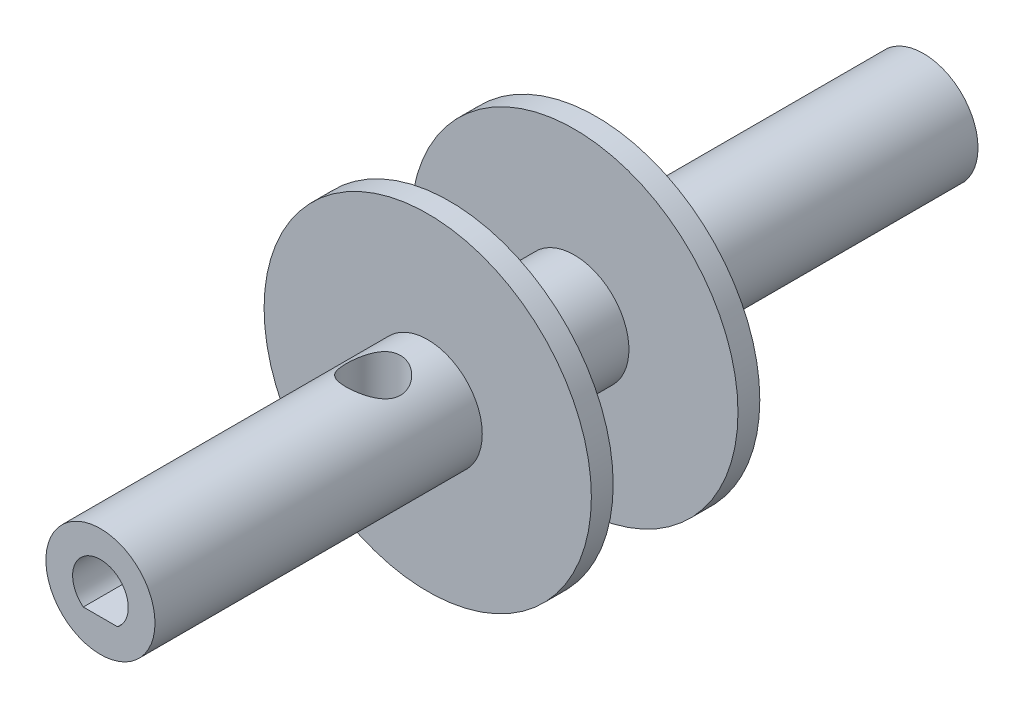
ISO-10303-21;
HEADER;
FILE_DESCRIPTION(('STEP AP214'),'2;1');
FILE_NAME('part.step','',(''),(''),'','','');
FILE_SCHEMA(('AUTOMOTIVE_DESIGN { 1 0 10303 214 1 1 1 1 }'));
ENDSEC;
DATA;
#1=APPLICATION_CONTEXT('core data for automotive mechanical design processes');
#2=APPLICATION_PROTOCOL_DEFINITION('international standard','automotive_design',2000,#1);
#3=PRODUCT_CONTEXT('',#1,'mechanical');
#4=PRODUCT('Part','Part','',(#3));
#5=PRODUCT_RELATED_PRODUCT_CATEGORY('part','',(#4));
#6=PRODUCT_DEFINITION_FORMATION('','',#4);
#7=PRODUCT_DEFINITION_CONTEXT('part definition',#1,'design');
#8=PRODUCT_DEFINITION('design','',#6,#7);
#9=PRODUCT_DEFINITION_SHAPE('','',#8);
#10=(LENGTH_UNIT() NAMED_UNIT(*) SI_UNIT(.MILLI.,.METRE.));
#11=(NAMED_UNIT(*) PLANE_ANGLE_UNIT() SI_UNIT($,.RADIAN.));
#12=(NAMED_UNIT(*) SI_UNIT($,.STERADIAN.) SOLID_ANGLE_UNIT());
#13=UNCERTAINTY_MEASURE_WITH_UNIT(LENGTH_MEASURE(1.E-05),#10,'distance_accuracy_value','');
#14=(GEOMETRIC_REPRESENTATION_CONTEXT(3) GLOBAL_UNCERTAINTY_ASSIGNED_CONTEXT((#13)) GLOBAL_UNIT_ASSIGNED_CONTEXT((#10,
#11,#12)) REPRESENTATION_CONTEXT('',''));
#15=CARTESIAN_POINT('',(0.,0.,0.));
#16=DIRECTION('',(0.,0.,1.));
#17=DIRECTION('',(1.,0.,0.));
#18=AXIS2_PLACEMENT_3D('',#15,#16,#17);
#19=CARTESIAN_POINT('',(0.,0.,0.));
#20=DIRECTION('',(0.,0.,1.));
#21=DIRECTION('',(1.,0.,0.));
#22=AXIS2_PLACEMENT_3D('',#19,#20,#21);
#23=PLANE('',#22);
#24=CARTESIAN_POINT('',(0.,0.,0.));
#25=DIRECTION('',(0.,0.,1.));
#26=DIRECTION('',(1.,0.,0.));
#27=AXIS2_PLACEMENT_3D('',#24,#25,#26);
#28=CIRCLE('',#27,6.35);
#29=CARTESIAN_POINT('',(6.35,0.,0.));
#30=VERTEX_POINT('',#29);
#31=EDGE_CURVE('E127',#30,#30,#28,.T.);
#32=ORIENTED_EDGE('',*,*,#31,.F.);
#33=EDGE_LOOP('',(#32));
#34=FACE_BOUND('',#33,.T.);
#35=DIRECTION('',(0.,1.,0.));
#36=VECTOR('',#35,1.);
#37=CARTESIAN_POINT('',(2.5527,0.,0.));
#38=LINE('',#37,#36);
#39=CARTESIAN_POINT('',(2.5527,-1.9928885969868,0.));
#40=VERTEX_POINT('',#39);
#41=CARTESIAN_POINT('',(2.5527,1.9928885969868,0.));
#42=VERTEX_POINT('',#41);
#43=EDGE_CURVE('E49',#40,#42,#38,.T.);
#44=ORIENTED_EDGE('',*,*,#43,.T.);
#45=CARTESIAN_POINT('',(0.,0.,0.));
#46=DIRECTION('',(0.,0.,-1.));
#47=DIRECTION('',(-1.,0.,0.));
#48=AXIS2_PLACEMENT_3D('',#45,#46,#47);
#49=CIRCLE('',#48,3.2385);
#50=EDGE_CURVE('E87',#40,#42,#49,.T.);
#51=ORIENTED_EDGE('',*,*,#50,.F.);
#52=EDGE_LOOP('',(#44,#51));
#53=FACE_BOUND('',#52,.T.);
#54=ADVANCED_FACE('F33',(#34,#53),#23,.F.);
#55=CARTESIAN_POINT('',(0.,0.,95.8088));
#56=DIRECTION('',(0.,0.,-1.));
#57=DIRECTION('',(-1.,0.,0.));
#58=AXIS2_PLACEMENT_3D('',#55,#56,#57);
#59=CYLINDRICAL_SURFACE('',#58,6.35);
#60=CARTESIAN_POINT('',(0.,0.,55.1688));
#61=DIRECTION('',(0.,0.,1.));
#62=DIRECTION('',(1.,0.,0.));
#63=AXIS2_PLACEMENT_3D('',#60,#61,#62);
#64=CIRCLE('',#63,6.35);
#65=CARTESIAN_POINT('',(6.35,0.,55.1688));
#66=VERTEX_POINT('',#65);
#67=EDGE_CURVE('E42',#66,#66,#64,.T.);
#68=ORIENTED_EDGE('',*,*,#67,.F.);
#69=EDGE_LOOP('',(#68));
#70=FACE_BOUND('',#69,.T.);
#71=CARTESIAN_POINT('',(0.,0.,40.64));
#72=DIRECTION('',(0.,0.,-1.));
#73=DIRECTION('',(-1.,0.,0.));
#74=AXIS2_PLACEMENT_3D('',#71,#72,#73);
#75=CIRCLE('',#74,6.35);
#76=CARTESIAN_POINT('',(-6.35,0.,40.64));
#77=VERTEX_POINT('',#76);
#78=EDGE_CURVE('E11',#77,#77,#75,.T.);
#79=ORIENTED_EDGE('',*,*,#78,.F.);
#80=EDGE_LOOP('',(#79));
#81=FACE_BOUND('',#80,.T.);
#82=ADVANCED_FACE('F158',(#70,#81),#59,.T.);
#83=CARTESIAN_POINT('',(0.,0.,55.1688));
#84=DIRECTION('',(0.,0.,1.));
#85=DIRECTION('',(1.,0.,0.));
#86=AXIS2_PLACEMENT_3D('',#83,#84,#85);
#87=CYLINDRICAL_SURFACE('',#86,19.05);
#88=CARTESIAN_POINT('',(0.,0.,55.1688));
#89=DIRECTION('',(0.,0.,1.));
#90=DIRECTION('',(1.,0.,0.));
#91=AXIS2_PLACEMENT_3D('',#88,#89,#90);
#92=CIRCLE('',#91,19.05);
#93=CARTESIAN_POINT('',(19.05,0.,55.1688));
#94=VERTEX_POINT('',#93);
#95=EDGE_CURVE('E116',#94,#94,#92,.T.);
#96=ORIENTED_EDGE('',*,*,#95,.T.);
#97=EDGE_LOOP('',(#96));
#98=FACE_BOUND('',#97,.T.);
#99=CARTESIAN_POINT('',(0.,0.,57.7088));
#100=DIRECTION('',(0.,0.,1.));
#101=DIRECTION('',(1.,0.,0.));
#102=AXIS2_PLACEMENT_3D('',#99,#100,#101);
#103=CIRCLE('',#102,19.05);
#104=CARTESIAN_POINT('',(19.05,0.,57.7088));
#105=VERTEX_POINT('',#104);
#106=EDGE_CURVE('E120',#105,#105,#103,.T.);
#107=ORIENTED_EDGE('',*,*,#106,.F.);
#108=EDGE_LOOP('',(#107));
#109=FACE_BOUND('',#108,.T.);
#110=ADVANCED_FACE('F163',(#98,#109),#87,.T.);
#111=CARTESIAN_POINT('',(0.,0.,55.1688));
#112=DIRECTION('',(0.,0.,1.));
#113=DIRECTION('',(1.,0.,0.));
#114=AXIS2_PLACEMENT_3D('',#111,#112,#113);
#115=PLANE('',#114);
#116=ORIENTED_EDGE('',*,*,#67,.T.);
#117=EDGE_LOOP('',(#116));
#118=FACE_BOUND('',#117,.T.);
#119=ORIENTED_EDGE('',*,*,#95,.F.);
#120=EDGE_LOOP('',(#119));
#121=FACE_BOUND('',#120,.T.);
#122=ADVANCED_FACE('F226',(#118,#121),#115,.F.);
#123=CARTESIAN_POINT('',(0.,0.,57.7088));
#124=DIRECTION('',(0.,0.,1.));
#125=DIRECTION('',(1.,0.,0.));
#126=AXIS2_PLACEMENT_3D('',#123,#124,#125);
#127=PLANE('',#126);
#128=CARTESIAN_POINT('',(0.,0.,57.7088));
#129=DIRECTION('',(0.,0.,1.));
#130=DIRECTION('',(1.,0.,0.));
#131=AXIS2_PLACEMENT_3D('',#128,#129,#130);
#132=CIRCLE('',#131,6.35);
#133=CARTESIAN_POINT('',(6.35,0.,57.7088));
#134=VERTEX_POINT('',#133);
#135=EDGE_CURVE('E119',#134,#134,#132,.T.);
#136=ORIENTED_EDGE('',*,*,#135,.F.);
#137=EDGE_LOOP('',(#136));
#138=FACE_BOUND('',#137,.T.);
#139=ORIENTED_EDGE('',*,*,#106,.T.);
#140=EDGE_LOOP('',(#139));
#141=FACE_BOUND('',#140,.T.);
#142=ADVANCED_FACE('F155',(#138,#141),#127,.T.);
#143=CARTESIAN_POINT('',(0.,0.,95.8088));
#144=DIRECTION('',(0.,0.,1.));
#145=DIRECTION('',(1.,0.,0.));
#146=AXIS2_PLACEMENT_3D('',#143,#144,#145);
#147=PLANE('',#146);
#148=DIRECTION('',(1.,0.,0.));
#149=VECTOR('',#148,1.);
#150=CARTESIAN_POINT('',(0.,-2.5527,95.8088));
#151=LINE('',#150,#149);
#152=CARTESIAN_POINT('',(-1.9928885969868,-2.5527,95.8088));
#153=VERTEX_POINT('',#152);
#154=CARTESIAN_POINT('',(1.9928885969868,-2.5527,95.8088));
#155=VERTEX_POINT('',#154);
#156=EDGE_CURVE('E57',#153,#155,#151,.T.);
#157=ORIENTED_EDGE('',*,*,#156,.F.);
#158=CARTESIAN_POINT('',(0.,0.,95.8088));
#159=DIRECTION('',(0.,0.,1.));
#160=DIRECTION('',(1.,0.,0.));
#161=AXIS2_PLACEMENT_3D('',#158,#159,#160);
#162=CIRCLE('',#161,3.2385);
#163=EDGE_CURVE('E99',#155,#153,#162,.T.);
#164=ORIENTED_EDGE('',*,*,#163,.F.);
#165=EDGE_LOOP('',(#157,#164));
#166=FACE_BOUND('',#165,.T.);
#167=CARTESIAN_POINT('',(0.,0.,95.8088));
#168=DIRECTION('',(0.,0.,1.));
#169=DIRECTION('',(1.,0.,0.));
#170=AXIS2_PLACEMENT_3D('',#167,#168,#169);
#171=CIRCLE('',#170,6.35);
#172=CARTESIAN_POINT('',(6.35,0.,95.8088));
#173=VERTEX_POINT('',#172);
#174=EDGE_CURVE('E123',#173,#173,#171,.T.);
#175=ORIENTED_EDGE('',*,*,#174,.T.);
#176=EDGE_LOOP('',(#175));
#177=FACE_BOUND('',#176,.T.);
#178=ADVANCED_FACE('F152',(#166,#177),#147,.T.);
#179=CARTESIAN_POINT('',(0.,-6.35,64.0588));
#180=DIRECTION('',(0.,1.,0.));
#181=DIRECTION('',(0.,0.,1.));
#182=AXIS2_PLACEMENT_3D('',#179,#180,#181);
#183=CYLINDRICAL_SURFACE('',#182,3.175);
#184=CARTESIAN_POINT('',(0.,6.35,67.2338));
#185=CARTESIAN_POINT('',(-0.0834969220594999,6.34999931166444,67.2337991122823));
#186=CARTESIAN_POINT('',(-0.167002655580042,6.34834758911701,67.230500125554));
#187=CARTESIAN_POINT('',(-0.33337833025878,6.34179105821714,67.2173541254501));
#188=CARTESIAN_POINT('',(-0.41624797895577,6.33688483467113,67.2075042634742));
#189=CARTESIAN_POINT('',(-0.663182030647008,6.31742426748325,67.168227934954));
#190=CARTESIAN_POINT('',(-0.825450146761554,6.29812827299425,67.1290749225986));
#191=CARTESIAN_POINT('',(-1.13965128900426,6.2489182313574,67.0268092887058));
#192=CARTESIAN_POINT('',(-1.29162180811869,6.21904547786825,66.9637897807566));
#193=CARTESIAN_POINT('',(-1.58264035037879,6.15142812041637,66.8160639263711));
#194=CARTESIAN_POINT('',(-1.72168939123018,6.11368413715877,66.731359289849));
#195=CARTESIAN_POINT('',(-1.99234108848171,6.03111096182982,66.5368303702658));
#196=CARTESIAN_POINT('',(-2.12298433900092,5.98599127270818,66.4257964222061));
#197=CARTESIAN_POINT('',(-2.36467069069853,5.89470535591056,66.1844033164272));
#198=CARTESIAN_POINT('',(-2.4756988560132,5.84853836069043,66.0540295702335));
#199=CARTESIAN_POINT('',(-2.68368848497886,5.75623634934464,65.7653790522467));
#200=CARTESIAN_POINT('',(-2.77889135161934,5.71038146176788,65.6057224686984));
#201=CARTESIAN_POINT('',(-2.90019349951535,5.64919759286363,65.3542520128256));
#202=CARTESIAN_POINT('',(-2.93705266116892,5.63006420805933,65.2683999381713));
#203=CARTESIAN_POINT('',(-3.00322508739606,5.59504604853267,65.0932143862936));
#204=CARTESIAN_POINT('',(-3.03254280972159,5.57915935583429,65.0038830018194));
#205=CARTESIAN_POINT('',(-3.08174263292982,5.55212611635049,64.8277894480352));
#206=CARTESIAN_POINT('',(-3.10208128111978,5.54075429137746,64.7411892059714));
#207=CARTESIAN_POINT('',(-3.13545600360765,5.52193654886444,64.5662127210056));
#208=CARTESIAN_POINT('',(-3.14849595237257,5.51448854851135,64.4778374462283));
#209=CARTESIAN_POINT('',(-3.1670771305344,5.50383875782919,64.3000932611514));
#210=CARTESIAN_POINT('',(-3.17262287599649,5.50063441026522,64.2107249820126));
#211=CARTESIAN_POINT('',(-3.17614778806993,5.49859788398609,64.0318192158219));
#212=CARTESIAN_POINT('',(-3.17412767659872,5.49976528812799,63.9422817457287));
#213=CARTESIAN_POINT('',(-3.1581193033026,5.50899190362733,63.6960521242756));
#214=CARTESIAN_POINT('',(-3.13621253452965,5.52160857357707,63.5399582701866));
#215=CARTESIAN_POINT('',(-3.07003746372168,5.55866493052824,63.2341533586935));
#216=CARTESIAN_POINT('',(-3.02576203854504,5.58310838358077,63.0844443509772));
#217=CARTESIAN_POINT('',(-2.91531509833647,5.64157885407237,62.7912557034358));
#218=CARTESIAN_POINT('',(-2.84865758129418,5.67581583876129,62.6480023900634));
#219=CARTESIAN_POINT('',(-2.69570761526054,5.75003268807633,62.374033913826));
#220=CARTESIAN_POINT('',(-2.60940634674629,5.79001512927804,62.2433244203915));
#221=CARTESIAN_POINT('',(-2.40685964249565,5.87734289018611,61.9806957257497));
#222=CARTESIAN_POINT('',(-2.28820488335253,5.92497898403936,61.8507246151435));
#223=CARTESIAN_POINT('',(-2.03058898448427,6.01813700574905,61.6117148571361));
#224=CARTESIAN_POINT('',(-1.89161819563546,6.06365791538158,61.5026862136413));
#225=CARTESIAN_POINT('',(-1.58913989972483,6.1500381059768,61.3038980802803));
#226=CARTESIAN_POINT('',(-1.42479265164789,6.19058274974572,61.21526851442));
#227=CARTESIAN_POINT('',(-1.08098023585583,6.25976272299952,61.0676419183646));
#228=CARTESIAN_POINT('',(-0.901527205073898,6.28840750578946,61.0086213588683));
#229=CARTESIAN_POINT('',(-0.548533610626836,6.32854759690358,60.9267405966009));
#230=CARTESIAN_POINT('',(-0.375734359385247,6.34126679122995,60.9012903274127));
#231=CARTESIAN_POINT('',(-0.0278752299448339,6.35231817716325,60.8791494777397));
#232=CARTESIAN_POINT('',(0.147183538060016,6.35065718436129,60.8824452728607));
#233=CARTESIAN_POINT('',(0.480164686080358,6.33384535408399,60.9162062359454));
#234=CARTESIAN_POINT('',(0.638363620564186,6.31975005060431,60.9445457914748));
#235=CARTESIAN_POINT('',(0.947441883052997,6.28085393924121,61.0242558782099));
#236=CARTESIAN_POINT('',(1.09832040207141,6.25605195113515,61.0756289484773));
#237=CARTESIAN_POINT('',(1.39347133182512,6.19709998236334,61.2012951309378));
#238=CARTESIAN_POINT('',(1.53743151047821,6.16270299610718,61.2762015841112));
#239=CARTESIAN_POINT('',(1.8112148234104,6.08787118465664,61.4461164256859));
#240=CARTESIAN_POINT('',(1.94103189959927,6.0474337895468,61.5411333773854));
#241=CARTESIAN_POINT('',(2.19636241342679,5.95973602709939,61.7593393503738));
#242=CARTESIAN_POINT('',(2.3202013468198,5.91219559251098,61.8843786071116));
#243=CARTESIAN_POINT('',(2.54589381918873,5.81858093231368,62.1535623551497));
#244=CARTESIAN_POINT('',(2.6477321493525,5.77250773963547,62.2977199523809));
#245=CARTESIAN_POINT('',(2.83117262876715,5.68487535288742,62.6098686019583));
#246=CARTESIAN_POINT('',(2.91155594998014,5.64364281441821,62.7786757695104));
#247=CARTESIAN_POINT('',(3.04191297152938,5.5744767953732,63.1301444648897));
#248=CARTESIAN_POINT('',(3.09192585492219,5.54652618900869,63.3127877978474));
#249=CARTESIAN_POINT('',(3.15551086037917,5.51057765714603,63.6679899564701));
#250=CARTESIAN_POINT('',(3.17212027309711,5.50092192343245,63.8398337504072));
#251=CARTESIAN_POINT('',(3.17718805563876,5.49800001145358,64.1840444424952));
#252=CARTESIAN_POINT('',(3.16565862768385,5.50472672904441,64.3564110815426));
#253=CARTESIAN_POINT('',(3.11761548073658,5.53205211477784,64.6794601030739));
#254=CARTESIAN_POINT('',(3.08358651207686,5.55126823076269,64.8306439417311));
#255=CARTESIAN_POINT('',(2.99458164828807,5.59977978302582,65.1249908301671));
#256=CARTESIAN_POINT('',(2.93959901505999,5.62907846127335,65.2681512828503));
#257=CARTESIAN_POINT('',(2.8061154442137,5.69685576337174,65.5530336994285));
#258=CARTESIAN_POINT('',(2.7262826050393,5.73581889480532,65.6940128093657));
#259=CARTESIAN_POINT('',(2.54682759156583,5.81772207082382,65.9614974317231));
#260=CARTESIAN_POINT('',(2.44719512169931,5.8606641782013,66.0879953599427));
#261=CARTESIAN_POINT('',(2.21680287661219,5.95192753761203,66.338897524177));
#262=CARTESIAN_POINT('',(2.08373188558713,6.00026839877346,66.4611797564128));
#263=CARTESIAN_POINT('',(1.79751265125245,6.0921234557675,66.6821978732331));
#264=CARTESIAN_POINT('',(1.64435365457428,6.13563504323042,66.7809210659827));
#265=CARTESIAN_POINT('',(1.40178715704488,6.19391073190243,66.9090802661971));
#266=CARTESIAN_POINT('',(1.31842200030919,6.21223173271383,66.9486005836814));
#267=CARTESIAN_POINT('',(1.14807701021671,6.24595363475603,67.0203994748237));
#268=CARTESIAN_POINT('',(1.06109897786307,6.26135597012704,67.0526816065343));
#269=CARTESIAN_POINT('',(0.88436132281311,6.28875097111981,67.109559345915));
#270=CARTESIAN_POINT('',(0.794608244970575,6.30075106809478,67.1341717181381));
#271=CARTESIAN_POINT('',(0.612925661591586,6.32100983571903,67.1754673895299));
#272=CARTESIAN_POINT('',(0.520997521680294,6.3292707916836,67.1921555321935));
#273=CARTESIAN_POINT('',(0.357531347524378,6.34032503263334,67.2144162848624));
#274=CARTESIAN_POINT('',(0.286274046488599,6.34394670812889,67.2216788212496));
#275=CARTESIAN_POINT('',(0.143346668941349,6.34878452045567,67.2313711265376));
#276=CARTESIAN_POINT('',(0.0716765810914267,6.35000059089052,67.2338007620468));
#277=CARTESIAN_POINT('',(0.,6.35,67.2338));
#278=B_SPLINE_CURVE_WITH_KNOTS('',3,(#184,#185,#186,#187,#188,#189,#190,#191,#192,#193,#194,
#195,#196,#197,#198,#199,#200,#201,#202,#203,#204,#205,#206,#207,#208,#209,#210,#211,#212,#213,
#214,#215,#216,#217,#218,#219,#220,#221,#222,#223,#224,#225,#226,#227,#228,#229,#230,#231,#232,
#233,#234,#235,#236,#237,#238,#239,#240,#241,#242,#243,#244,#245,#246,#247,#248,#249,#250,#251,
#252,#253,#254,#255,#256,#257,#258,#259,#260,#261,#262,#263,#264,#265,#266,#267,#268,#269,#270,
#271,#272,#273,#274,#275,#276,#277),.UNSPECIFIED.,.T.,.F.,(4,2,2,2,2,2,2,2,2,2,2,2,2,2,2,2,2,2,
2,2,2,2,2,2,2,2,2,2,2,2,2,2,2,2,2,2,2,2,2,2,2,2,2,2,2,2,4),(0.,0.25041561210268,
0.500940186864012,1.00234854488129,1.50182051324263,2.00125310940106,2.53090025348452,
3.06094897410614,3.63210298373099,3.91787290005988,4.20347350732851,4.47213270490104,
4.74064915090148,5.00900371453885,5.27733267302574,5.74927594687737,6.22136960256846,
6.70445970327763,7.1877671279402,7.7323564652788,8.27720530143645,8.84735553323665,
9.41705196489304,9.93956405039339,10.4618285011675,10.9436138594975,11.4254523397102,
11.9210677568139,12.4168946391879,12.9614122158798,13.5063050164601,14.0775857365549,
14.6481278321882,15.1639000911419,15.6794487286237,16.1458838633213,16.6124691169503,
17.1104020806943,17.6085946442304,18.1673210354482,18.7263477502426,19.0082017078365,
19.2899168101042,19.5710117490933,19.8519346536844,20.0668939492148,20.2818591776892),.UNSPECIFIED.);
#279=CARTESIAN_POINT('',(0.,6.35,67.2338));
#280=VERTEX_POINT('',#279);
#281=EDGE_CURVE('E199',#280,#280,#278,.T.);
#282=ORIENTED_EDGE('',*,*,#281,.F.);
#283=EDGE_LOOP('',(#282));
#284=FACE_BOUND('',#283,.T.);
#285=CARTESIAN_POINT('',(0.,-6.35,67.2338));
#286=CARTESIAN_POINT('',(0.0834969220594999,-6.34999931166444,67.2337991122823));
#287=CARTESIAN_POINT('',(0.167002655580042,-6.34834758911701,67.230500125554));
#288=CARTESIAN_POINT('',(0.33337833025878,-6.34179105821714,67.2173541254501));
#289=CARTESIAN_POINT('',(0.41624797895577,-6.33688483467113,67.2075042634742));
#290=CARTESIAN_POINT('',(0.663182030647008,-6.31742426748325,67.168227934954));
#291=CARTESIAN_POINT('',(0.825450146761554,-6.29812827299425,67.1290749225986));
#292=CARTESIAN_POINT('',(1.13965128900426,-6.2489182313574,67.0268092887058));
#293=CARTESIAN_POINT('',(1.29162180811869,-6.21904547786825,66.9637897807566));
#294=CARTESIAN_POINT('',(1.58264035037879,-6.15142812041637,66.8160639263711));
#295=CARTESIAN_POINT('',(1.72168939123018,-6.11368413715877,66.731359289849));
#296=CARTESIAN_POINT('',(1.99234108848171,-6.03111096182982,66.5368303702658));
#297=CARTESIAN_POINT('',(2.12298433900092,-5.98599127270818,66.4257964222061));
#298=CARTESIAN_POINT('',(2.36467069069853,-5.89470535591056,66.1844033164272));
#299=CARTESIAN_POINT('',(2.4756988560132,-5.84853836069043,66.0540295702335));
#300=CARTESIAN_POINT('',(2.68368848497886,-5.75623634934464,65.7653790522467));
#301=CARTESIAN_POINT('',(2.77889135161934,-5.71038146176788,65.6057224686984));
#302=CARTESIAN_POINT('',(2.90019349951535,-5.64919759286363,65.3542520128256));
#303=CARTESIAN_POINT('',(2.93705266116892,-5.63006420805933,65.2683999381713));
#304=CARTESIAN_POINT('',(3.00322508739606,-5.59504604853267,65.0932143862936));
#305=CARTESIAN_POINT('',(3.03254280972159,-5.57915935583429,65.0038830018194));
#306=CARTESIAN_POINT('',(3.08174263292982,-5.55212611635049,64.8277894480352));
#307=CARTESIAN_POINT('',(3.10208128111978,-5.54075429137746,64.7411892059714));
#308=CARTESIAN_POINT('',(3.13545600360765,-5.52193654886444,64.5662127210056));
#309=CARTESIAN_POINT('',(3.14849595237257,-5.51448854851135,64.4778374462283));
#310=CARTESIAN_POINT('',(3.1670771305344,-5.50383875782919,64.3000932611514));
#311=CARTESIAN_POINT('',(3.17262287599649,-5.50063441026522,64.2107249820126));
#312=CARTESIAN_POINT('',(3.17614778806993,-5.49859788398609,64.0318192158219));
#313=CARTESIAN_POINT('',(3.17412767659872,-5.49976528812799,63.9422817457287));
#314=CARTESIAN_POINT('',(3.1581193033026,-5.50899190362733,63.6960521242756));
#315=CARTESIAN_POINT('',(3.13621253452965,-5.52160857357707,63.5399582701866));
#316=CARTESIAN_POINT('',(3.07003746372168,-5.55866493052824,63.2341533586935));
#317=CARTESIAN_POINT('',(3.02576203854504,-5.58310838358077,63.0844443509772));
#318=CARTESIAN_POINT('',(2.91531509833647,-5.64157885407237,62.7912557034358));
#319=CARTESIAN_POINT('',(2.84865758129418,-5.67581583876129,62.6480023900634));
#320=CARTESIAN_POINT('',(2.69570761526054,-5.75003268807633,62.374033913826));
#321=CARTESIAN_POINT('',(2.60940634674629,-5.79001512927804,62.2433244203915));
#322=CARTESIAN_POINT('',(2.40685964249565,-5.87734289018611,61.9806957257497));
#323=CARTESIAN_POINT('',(2.28820488335253,-5.92497898403936,61.8507246151435));
#324=CARTESIAN_POINT('',(2.03058898448427,-6.01813700574905,61.6117148571361));
#325=CARTESIAN_POINT('',(1.89161819563546,-6.06365791538158,61.5026862136413));
#326=CARTESIAN_POINT('',(1.58913989972483,-6.1500381059768,61.3038980802803));
#327=CARTESIAN_POINT('',(1.42479265164789,-6.19058274974572,61.21526851442));
#328=CARTESIAN_POINT('',(1.08098023585583,-6.25976272299952,61.0676419183646));
#329=CARTESIAN_POINT('',(0.901527205073898,-6.28840750578946,61.0086213588683));
#330=CARTESIAN_POINT('',(0.548533610626836,-6.32854759690358,60.9267405966009));
#331=CARTESIAN_POINT('',(0.375734359385247,-6.34126679122995,60.9012903274127));
#332=CARTESIAN_POINT('',(0.0278752299448339,-6.35231817716325,60.8791494777397));
#333=CARTESIAN_POINT('',(-0.147183538060016,-6.35065718436129,60.8824452728607));
#334=CARTESIAN_POINT('',(-0.480164686080358,-6.33384535408399,60.9162062359454));
#335=CARTESIAN_POINT('',(-0.638363620564186,-6.31975005060431,60.9445457914748));
#336=CARTESIAN_POINT('',(-0.947441883052997,-6.28085393924121,61.0242558782099));
#337=CARTESIAN_POINT('',(-1.09832040207141,-6.25605195113515,61.0756289484773));
#338=CARTESIAN_POINT('',(-1.39347133182512,-6.19709998236334,61.2012951309378));
#339=CARTESIAN_POINT('',(-1.53743151047821,-6.16270299610718,61.2762015841112));
#340=CARTESIAN_POINT('',(-1.8112148234104,-6.08787118465664,61.4461164256859));
#341=CARTESIAN_POINT('',(-1.94103189959927,-6.0474337895468,61.5411333773854));
#342=CARTESIAN_POINT('',(-2.19636241342679,-5.95973602709939,61.7593393503738));
#343=CARTESIAN_POINT('',(-2.3202013468198,-5.91219559251098,61.8843786071116));
#344=CARTESIAN_POINT('',(-2.54589381918873,-5.81858093231368,62.1535623551497));
#345=CARTESIAN_POINT('',(-2.6477321493525,-5.77250773963547,62.2977199523809));
#346=CARTESIAN_POINT('',(-2.83117262876715,-5.68487535288742,62.6098686019583));
#347=CARTESIAN_POINT('',(-2.91155594998014,-5.64364281441821,62.7786757695104));
#348=CARTESIAN_POINT('',(-3.04191297152938,-5.5744767953732,63.1301444648897));
#349=CARTESIAN_POINT('',(-3.09192585492219,-5.54652618900869,63.3127877978474));
#350=CARTESIAN_POINT('',(-3.15551086037917,-5.51057765714603,63.6679899564701));
#351=CARTESIAN_POINT('',(-3.17212027309711,-5.50092192343245,63.8398337504072));
#352=CARTESIAN_POINT('',(-3.17718805563876,-5.49800001145358,64.1840444424952));
#353=CARTESIAN_POINT('',(-3.16565862768385,-5.50472672904441,64.3564110815426));
#354=CARTESIAN_POINT('',(-3.11761548073658,-5.53205211477784,64.6794601030739));
#355=CARTESIAN_POINT('',(-3.08358651207686,-5.55126823076269,64.8306439417311));
#356=CARTESIAN_POINT('',(-2.99458164828807,-5.59977978302582,65.1249908301671));
#357=CARTESIAN_POINT('',(-2.93959901505999,-5.62907846127335,65.2681512828503));
#358=CARTESIAN_POINT('',(-2.8061154442137,-5.69685576337174,65.5530336994285));
#359=CARTESIAN_POINT('',(-2.7262826050393,-5.73581889480532,65.6940128093657));
#360=CARTESIAN_POINT('',(-2.54682759156583,-5.81772207082382,65.9614974317231));
#361=CARTESIAN_POINT('',(-2.44719512169931,-5.8606641782013,66.0879953599427));
#362=CARTESIAN_POINT('',(-2.21680287661219,-5.95192753761203,66.338897524177));
#363=CARTESIAN_POINT('',(-2.08373188558713,-6.00026839877346,66.4611797564128));
#364=CARTESIAN_POINT('',(-1.79751265125245,-6.0921234557675,66.6821978732331));
#365=CARTESIAN_POINT('',(-1.64435365457428,-6.13563504323042,66.7809210659827));
#366=CARTESIAN_POINT('',(-1.40178715704488,-6.19391073190243,66.9090802661971));
#367=CARTESIAN_POINT('',(-1.31842200030919,-6.21223173271383,66.9486005836814));
#368=CARTESIAN_POINT('',(-1.14807701021671,-6.24595363475603,67.0203994748237));
#369=CARTESIAN_POINT('',(-1.06109897786307,-6.26135597012704,67.0526816065343));
#370=CARTESIAN_POINT('',(-0.88436132281311,-6.28875097111981,67.109559345915));
#371=CARTESIAN_POINT('',(-0.794608244970575,-6.30075106809478,67.1341717181381));
#372=CARTESIAN_POINT('',(-0.612925661591586,-6.32100983571903,67.1754673895299));
#373=CARTESIAN_POINT('',(-0.520997521680294,-6.3292707916836,67.1921555321935));
#374=CARTESIAN_POINT('',(-0.357531347524378,-6.34032503263334,67.2144162848624));
#375=CARTESIAN_POINT('',(-0.286274046488599,-6.34394670812889,67.2216788212496));
#376=CARTESIAN_POINT('',(-0.143346668941349,-6.34878452045567,67.2313711265376));
#377=CARTESIAN_POINT('',(-0.0716765810914267,-6.35000059089052,67.2338007620468));
#378=CARTESIAN_POINT('',(0.,-6.35,67.2338));
#379=B_SPLINE_CURVE_WITH_KNOTS('',3,(#285,#286,#287,#288,#289,#290,#291,#292,#293,#294,#295,
#296,#297,#298,#299,#300,#301,#302,#303,#304,#305,#306,#307,#308,#309,#310,#311,#312,#313,#314,
#315,#316,#317,#318,#319,#320,#321,#322,#323,#324,#325,#326,#327,#328,#329,#330,#331,#332,#333,
#334,#335,#336,#337,#338,#339,#340,#341,#342,#343,#344,#345,#346,#347,#348,#349,#350,#351,#352,
#353,#354,#355,#356,#357,#358,#359,#360,#361,#362,#363,#364,#365,#366,#367,#368,#369,#370,#371,
#372,#373,#374,#375,#376,#377,#378),.UNSPECIFIED.,.T.,.F.,(4,2,2,2,2,2,2,2,2,2,2,2,2,2,2,2,2,2,
2,2,2,2,2,2,2,2,2,2,2,2,2,2,2,2,2,2,2,2,2,2,2,2,2,2,2,2,4),(0.,0.25041561210268,
0.500940186864012,1.00234854488129,1.50182051324263,2.00125310940106,2.53090025348452,
3.06094897410614,3.63210298373099,3.91787290005988,4.20347350732851,4.47213270490104,
4.74064915090148,5.00900371453885,5.27733267302574,5.74927594687737,6.22136960256846,
6.70445970327763,7.1877671279402,7.7323564652788,8.27720530143645,8.84735553323665,
9.41705196489304,9.93956405039339,10.4618285011675,10.9436138594975,11.4254523397102,
11.9210677568139,12.4168946391879,12.9614122158798,13.5063050164601,14.0775857365549,
14.6481278321882,15.1639000911419,15.6794487286237,16.1458838633213,16.6124691169503,
17.1104020806943,17.6085946442304,18.1673210354482,18.7263477502426,19.0082017078365,
19.2899168101042,19.5710117490933,19.8519346536844,20.0668939492148,20.2818591776892),.UNSPECIFIED.);
#380=CARTESIAN_POINT('',(0.,-6.35,67.2338));
#381=VERTEX_POINT('',#380);
#382=EDGE_CURVE('E195',#381,#381,#379,.T.);
#383=ORIENTED_EDGE('',*,*,#382,.F.);
#384=EDGE_LOOP('',(#383));
#385=FACE_BOUND('',#384,.T.);
#386=ADVANCED_FACE('F149',(#284,#385),#183,.F.);
#387=ORIENTED_EDGE('',*,*,#135,.T.);
#388=EDGE_LOOP('',(#387));
#389=FACE_BOUND('',#388,.T.);
#390=ORIENTED_EDGE('',*,*,#382,.T.);
#391=EDGE_LOOP('',(#390));
#392=FACE_BOUND('',#391,.T.);
#393=ORIENTED_EDGE('',*,*,#281,.T.);
#394=EDGE_LOOP('',(#393));
#395=FACE_BOUND('',#394,.T.);
#396=ORIENTED_EDGE('',*,*,#174,.F.);
#397=EDGE_LOOP('',(#396));
#398=FACE_BOUND('',#397,.T.);
#399=ADVANCED_FACE('F35',(#389,#392,#395,#398),#59,.T.);
#400=CARTESIAN_POINT('',(0.,0.,40.64));
#401=DIRECTION('',(0.,0.,-1.));
#402=DIRECTION('',(-1.,0.,0.));
#403=AXIS2_PLACEMENT_3D('',#400,#401,#402);
#404=CYLINDRICAL_SURFACE('',#403,19.05);
#405=CARTESIAN_POINT('',(0.,0.,40.64));
#406=DIRECTION('',(0.,0.,-1.));
#407=DIRECTION('',(-1.,0.,0.));
#408=AXIS2_PLACEMENT_3D('',#405,#406,#407);
#409=CIRCLE('',#408,19.05);
#410=CARTESIAN_POINT('',(-19.05,0.,40.64));
#411=VERTEX_POINT('',#410);
#412=EDGE_CURVE('E110',#411,#411,#409,.T.);
#413=ORIENTED_EDGE('',*,*,#412,.T.);
#414=EDGE_LOOP('',(#413));
#415=FACE_BOUND('',#414,.T.);
#416=CARTESIAN_POINT('',(0.,0.,38.1));
#417=DIRECTION('',(0.,0.,-1.));
#418=DIRECTION('',(-1.,0.,0.));
#419=AXIS2_PLACEMENT_3D('',#416,#417,#418);
#420=CIRCLE('',#419,19.05);
#421=CARTESIAN_POINT('',(-19.05,0.,38.1));
#422=VERTEX_POINT('',#421);
#423=EDGE_CURVE('E108',#422,#422,#420,.T.);
#424=ORIENTED_EDGE('',*,*,#423,.F.);
#425=EDGE_LOOP('',(#424));
#426=FACE_BOUND('',#425,.T.);
#427=ADVANCED_FACE('F179',(#415,#426),#404,.T.);
#428=CARTESIAN_POINT('',(0.,0.,40.64));
#429=DIRECTION('',(0.,0.,-1.));
#430=DIRECTION('',(-1.,0.,0.));
#431=AXIS2_PLACEMENT_3D('',#428,#429,#430);
#432=PLANE('',#431);
#433=ORIENTED_EDGE('',*,*,#78,.T.);
#434=EDGE_LOOP('',(#433));
#435=FACE_BOUND('',#434,.T.);
#436=ORIENTED_EDGE('',*,*,#412,.F.);
#437=EDGE_LOOP('',(#436));
#438=FACE_BOUND('',#437,.T.);
#439=ADVANCED_FACE('F185',(#435,#438),#432,.F.);
#440=CARTESIAN_POINT('',(0.,0.,38.1));
#441=DIRECTION('',(0.,0.,-1.));
#442=DIRECTION('',(-1.,0.,0.));
#443=AXIS2_PLACEMENT_3D('',#440,#441,#442);
#444=PLANE('',#443);
#445=CARTESIAN_POINT('',(0.,0.,38.1));
#446=DIRECTION('',(0.,0.,-1.));
#447=DIRECTION('',(-1.,0.,0.));
#448=AXIS2_PLACEMENT_3D('',#445,#446,#447);
#449=CIRCLE('',#448,6.35);
#450=CARTESIAN_POINT('',(-6.35,0.,38.1));
#451=VERTEX_POINT('',#450);
#452=EDGE_CURVE('E113',#451,#451,#449,.T.);
#453=ORIENTED_EDGE('',*,*,#452,.F.);
#454=EDGE_LOOP('',(#453));
#455=FACE_BOUND('',#454,.T.);
#456=ORIENTED_EDGE('',*,*,#423,.T.);
#457=EDGE_LOOP('',(#456));
#458=FACE_BOUND('',#457,.T.);
#459=ADVANCED_FACE('F147',(#455,#458),#444,.T.);
#460=CARTESIAN_POINT('',(0.,-6.35,31.75));
#461=DIRECTION('',(0.,1.,0.));
#462=DIRECTION('',(0.,0.,1.));
#463=AXIS2_PLACEMENT_3D('',#460,#461,#462);
#464=CYLINDRICAL_SURFACE('',#463,3.175);
#465=CARTESIAN_POINT('',(0.,6.35,34.925));
#466=CARTESIAN_POINT('',(-0.0834969220594997,6.34999931166444,34.9249991122824));
#467=CARTESIAN_POINT('',(-0.167002655580042,6.34834758911701,34.921700125554));
#468=CARTESIAN_POINT('',(-0.333378330258781,6.34179105821714,34.9085541254501));
#469=CARTESIAN_POINT('',(-0.416247978955771,6.33688483467113,34.8987042634742));
#470=CARTESIAN_POINT('',(-0.663182030647009,6.31742426748325,34.859427934954));
#471=CARTESIAN_POINT('',(-0.825450146761553,6.29812827299425,34.8202749225986));
#472=CARTESIAN_POINT('',(-1.13965128900426,6.2489182313574,34.7180092887059));
#473=CARTESIAN_POINT('',(-1.29162180811868,6.21904547786825,34.6549897807566));
#474=CARTESIAN_POINT('',(-1.58264035037879,6.15142812041637,34.5072639263711));
#475=CARTESIAN_POINT('',(-1.72168939123018,6.11368413715877,34.422559289849));
#476=CARTESIAN_POINT('',(-1.99234108848171,6.03111096182982,34.2280303702658));
#477=CARTESIAN_POINT('',(-2.12298433900091,5.98599127270818,34.1169964222061));
#478=CARTESIAN_POINT('',(-2.36467069069853,5.89470535591056,33.8756033164272));
#479=CARTESIAN_POINT('',(-2.47569885601321,5.84853836069043,33.7452295702336));
#480=CARTESIAN_POINT('',(-2.68368848497886,5.75623634934464,33.4565790522467));
#481=CARTESIAN_POINT('',(-2.77889135161933,5.71038146176788,33.2969224686984));
#482=CARTESIAN_POINT('',(-2.90019349951534,5.64919759286363,33.0454520128256));
#483=CARTESIAN_POINT('',(-2.93705266116891,5.63006420805933,32.9595999381713));
#484=CARTESIAN_POINT('',(-3.00322508739606,5.59504604853268,32.7844143862936));
#485=CARTESIAN_POINT('',(-3.03254280972159,5.57915935583429,32.6950830018194));
#486=CARTESIAN_POINT('',(-3.08174263292982,5.55212611635049,32.5189894480353));
#487=CARTESIAN_POINT('',(-3.10208128111978,5.54075429137746,32.4323892059714));
#488=CARTESIAN_POINT('',(-3.13545600360765,5.52193654886444,32.2574127210056));
#489=CARTESIAN_POINT('',(-3.14849595237257,5.51448854851135,32.1690374462283));
#490=CARTESIAN_POINT('',(-3.1670771305344,5.50383875782919,31.9912932611514));
#491=CARTESIAN_POINT('',(-3.17262287599649,5.50063441026522,31.9019249820126));
#492=CARTESIAN_POINT('',(-3.17614778806993,5.49859788398609,31.7230192158219));
#493=CARTESIAN_POINT('',(-3.17412767659871,5.49976528812799,31.6334817457287));
#494=CARTESIAN_POINT('',(-3.1581193033026,5.50899190362733,31.3872521242756));
#495=CARTESIAN_POINT('',(-3.13621253452965,5.52160857357707,31.2311582701866));
#496=CARTESIAN_POINT('',(-3.07003746372167,5.55866493052824,30.9253533586935));
#497=CARTESIAN_POINT('',(-3.02576203854504,5.58310838358077,30.7756443509772));
#498=CARTESIAN_POINT('',(-2.91531509833647,5.64157885407237,30.4824557034359));
#499=CARTESIAN_POINT('',(-2.84865758129417,5.67581583876129,30.3392023900634));
#500=CARTESIAN_POINT('',(-2.69570761526054,5.75003268807633,30.065233913826));
#501=CARTESIAN_POINT('',(-2.60940634674629,5.79001512927804,29.9345244203915));
#502=CARTESIAN_POINT('',(-2.40685964249565,5.87734289018611,29.6718957257497));
#503=CARTESIAN_POINT('',(-2.28820488335253,5.92497898403936,29.5419246151435));
#504=CARTESIAN_POINT('',(-2.03058898448427,6.01813700574905,29.3029148571362));
#505=CARTESIAN_POINT('',(-1.89161819563546,6.06365791538158,29.1938862136413));
#506=CARTESIAN_POINT('',(-1.58913989972482,6.1500381059768,28.9950980802803));
#507=CARTESIAN_POINT('',(-1.42479265164788,6.19058274974572,28.9064685144201));
#508=CARTESIAN_POINT('',(-1.08098023585583,6.25976272299952,28.7588419183647));
#509=CARTESIAN_POINT('',(-0.901527205073894,6.28840750578946,28.6998213588683));
#510=CARTESIAN_POINT('',(-0.548533610626832,6.32854759690358,28.617940596601));
#511=CARTESIAN_POINT('',(-0.375734359385243,6.34126679122995,28.5924903274127));
#512=CARTESIAN_POINT('',(-0.0278752299448298,6.35231817716325,28.5703494777397));
#513=CARTESIAN_POINT('',(0.147183538060021,6.35065718436129,28.5736452728607));
#514=CARTESIAN_POINT('',(0.480164686080364,6.33384535408399,28.6074062359454));
#515=CARTESIAN_POINT('',(0.638363620564192,6.31975005060431,28.6357457914748));
#516=CARTESIAN_POINT('',(0.947441883053002,6.28085393924121,28.7154558782099));
#517=CARTESIAN_POINT('',(1.09832040207141,6.25605195113515,28.7668289484773));
#518=CARTESIAN_POINT('',(1.39347133182512,6.19709998236334,28.8924951309378));
#519=CARTESIAN_POINT('',(1.53743151047822,6.16270299610717,28.9674015841112));
#520=CARTESIAN_POINT('',(1.8112148234104,6.08787118465664,29.1373164256859));
#521=CARTESIAN_POINT('',(1.94103189959928,6.0474337895468,29.2323333773854));
#522=CARTESIAN_POINT('',(2.19636241342679,5.95973602709938,29.4505393503738));
#523=CARTESIAN_POINT('',(2.3202013468198,5.91219559251098,29.5755786071116));
#524=CARTESIAN_POINT('',(2.54589381918874,5.81858093231368,29.8447623551498));
#525=CARTESIAN_POINT('',(2.64773214935251,5.77250773963546,29.9889199523809));
#526=CARTESIAN_POINT('',(2.83117262876716,5.68487535288742,30.3010686019584));
#527=CARTESIAN_POINT('',(2.91155594998014,5.64364281441821,30.4698757695104));
#528=CARTESIAN_POINT('',(3.04191297152939,5.5744767953732,30.8213444648897));
#529=CARTESIAN_POINT('',(3.0919258549222,5.54652618900868,31.0039877978474));
#530=CARTESIAN_POINT('',(3.15551086037918,5.51057765714603,31.3591899564702));
#531=CARTESIAN_POINT('',(3.17212027309711,5.50092192343245,31.5310337504072));
#532=CARTESIAN_POINT('',(3.17718805563876,5.49800001145358,31.8752444424952));
#533=CARTESIAN_POINT('',(3.16565862768386,5.5047267290444,32.0476110815426));
#534=CARTESIAN_POINT('',(3.11761548073658,5.53205211477784,32.3706601030739));
#535=CARTESIAN_POINT('',(3.08358651207686,5.55126823076269,32.5218439417312));
#536=CARTESIAN_POINT('',(2.99458164828807,5.59977978302582,32.8161908301672));
#537=CARTESIAN_POINT('',(2.93959901505999,5.62907846127335,32.9593512828503));
#538=CARTESIAN_POINT('',(2.8061154442137,5.69685576337174,33.2442336994285));
#539=CARTESIAN_POINT('',(2.72628260503929,5.73581889480532,33.3852128093657));
#540=CARTESIAN_POINT('',(2.54682759156583,5.81772207082382,33.6526974317231));
#541=CARTESIAN_POINT('',(2.44719512169932,5.8606641782013,33.7791953599427));
#542=CARTESIAN_POINT('',(2.21680287661219,5.95192753761203,34.0300975241771));
#543=CARTESIAN_POINT('',(2.08373188558713,6.00026839877346,34.1523797564128));
#544=CARTESIAN_POINT('',(1.79751265125244,6.0921234557675,34.3733978732331));
#545=CARTESIAN_POINT('',(1.64435365457428,6.13563504323043,34.4721210659827));
#546=CARTESIAN_POINT('',(1.40178715704487,6.19391073190243,34.6002802661971));
#547=CARTESIAN_POINT('',(1.31842200030918,6.21223173271383,34.6398005836814));
#548=CARTESIAN_POINT('',(1.1480770102167,6.24595363475603,34.7115994748237));
#549=CARTESIAN_POINT('',(1.06109897786306,6.26135597012704,34.7438816065344));
#550=CARTESIAN_POINT('',(0.884361322813111,6.28875097111981,34.800759345915));
#551=CARTESIAN_POINT('',(0.794608244970573,6.30075106809478,34.8253717181381));
#552=CARTESIAN_POINT('',(0.612925661591583,6.32100983571903,34.8666673895299));
#553=CARTESIAN_POINT('',(0.520997521680292,6.3292707916836,34.8833555321935));
#554=CARTESIAN_POINT('',(0.357531347524376,6.34032503263334,34.9056162848624));
#555=CARTESIAN_POINT('',(0.286274046488597,6.34394670812889,34.9128788212496));
#556=CARTESIAN_POINT('',(0.143346668941347,6.34878452045567,34.9225711265376));
#557=CARTESIAN_POINT('',(0.071676581091426,6.35000059089052,34.9250007620468));
#558=CARTESIAN_POINT('',(0.,6.35,34.925));
#559=B_SPLINE_CURVE_WITH_KNOTS('',3,(#465,#466,#467,#468,#469,#470,#471,#472,#473,#474,#475,
#476,#477,#478,#479,#480,#481,#482,#483,#484,#485,#486,#487,#488,#489,#490,#491,#492,#493,#494,
#495,#496,#497,#498,#499,#500,#501,#502,#503,#504,#505,#506,#507,#508,#509,#510,#511,#512,#513,
#514,#515,#516,#517,#518,#519,#520,#521,#522,#523,#524,#525,#526,#527,#528,#529,#530,#531,#532,
#533,#534,#535,#536,#537,#538,#539,#540,#541,#542,#543,#544,#545,#546,#547,#548,#549,#550,#551,
#552,#553,#554,#555,#556,#557,#558),.UNSPECIFIED.,.T.,.F.,(4,2,2,2,2,2,2,2,2,2,2,2,2,2,2,2,2,2,
2,2,2,2,2,2,2,2,2,2,2,2,2,2,2,2,2,2,2,2,2,2,2,2,2,2,2,2,4),(0.,0.25041561210268,
0.500940186864014,1.00234854488129,1.50182051324263,2.00125310940106,2.53090025348452,
3.06094897410615,3.63210298373098,3.91787290005988,4.20347350732849,4.47213270490102,
4.74064915090148,5.00900371453886,5.27733267302575,5.74927594687738,6.22136960256845,
6.70445970327763,7.1877671279402,7.7323564652788,8.27720530143645,8.84735553323665,
9.41705196489303,9.93956405039338,10.4618285011675,10.9436138594975,11.4254523397102,
11.9210677568139,12.4168946391879,12.9614122158798,13.5063050164601,14.0775857365549,
14.6481278321882,15.1639000911419,15.6794487286237,16.1458838633213,16.6124691169503,
17.1104020806943,17.6085946442304,18.1673210354482,18.7263477502426,19.0082017078365,
19.2899168101042,19.5710117490933,19.8519346536844,20.0668939492148,20.2818591776892),.UNSPECIFIED.);
#560=CARTESIAN_POINT('',(0.,6.35,34.925));
#561=VERTEX_POINT('',#560);
#562=EDGE_CURVE('E126',#561,#561,#559,.T.);
#563=ORIENTED_EDGE('',*,*,#562,.F.);
#564=EDGE_LOOP('',(#563));
#565=FACE_BOUND('',#564,.T.);
#566=CARTESIAN_POINT('',(0.,-6.35,34.925));
#567=CARTESIAN_POINT('',(0.083496922059502,-6.34999931166444,34.9249991122824));
#568=CARTESIAN_POINT('',(0.167002655580044,-6.34834758911701,34.921700125554));
#569=CARTESIAN_POINT('',(0.333378330258783,-6.34179105821714,34.9085541254501));
#570=CARTESIAN_POINT('',(0.416247978955774,-6.33688483467113,34.8987042634742));
#571=CARTESIAN_POINT('',(0.663182030647011,-6.31742426748325,34.859427934954));
#572=CARTESIAN_POINT('',(0.825450146761555,-6.29812827299425,34.8202749225986));
#573=CARTESIAN_POINT('',(1.13965128900426,-6.2489182313574,34.7180092887059));
#574=CARTESIAN_POINT('',(1.29162180811869,-6.21904547786825,34.6549897807566));
#575=CARTESIAN_POINT('',(1.58264035037879,-6.15142812041637,34.5072639263711));
#576=CARTESIAN_POINT('',(1.72168939123018,-6.11368413715877,34.422559289849));
#577=CARTESIAN_POINT('',(1.99234108848171,-6.03111096182982,34.2280303702658));
#578=CARTESIAN_POINT('',(2.12298433900092,-5.98599127270818,34.1169964222061));
#579=CARTESIAN_POINT('',(2.36467069069854,-5.89470535591056,33.8756033164272));
#580=CARTESIAN_POINT('',(2.47569885601321,-5.84853836069043,33.7452295702336));
#581=CARTESIAN_POINT('',(2.68368848497886,-5.75623634934464,33.4565790522467));
#582=CARTESIAN_POINT('',(2.77889135161934,-5.71038146176788,33.2969224686984));
#583=CARTESIAN_POINT('',(2.90019349951535,-5.64919759286363,33.0454520128256));
#584=CARTESIAN_POINT('',(2.93705266116892,-5.63006420805933,32.9595999381713));
#585=CARTESIAN_POINT('',(3.00322508739606,-5.59504604853267,32.7844143862936));
#586=CARTESIAN_POINT('',(3.03254280972159,-5.57915935583429,32.6950830018194));
#587=CARTESIAN_POINT('',(3.08174263292982,-5.55212611635049,32.5189894480353));
#588=CARTESIAN_POINT('',(3.10208128111978,-5.54075429137746,32.4323892059714));
#589=CARTESIAN_POINT('',(3.13545600360765,-5.52193654886444,32.2574127210056));
#590=CARTESIAN_POINT('',(3.14849595237258,-5.51448854851135,32.1690374462283));
#591=CARTESIAN_POINT('',(3.1670771305344,-5.50383875782918,31.9912932611514));
#592=CARTESIAN_POINT('',(3.1726228759965,-5.50063441026522,31.9019249820126));
#593=CARTESIAN_POINT('',(3.17614778806993,-5.49859788398609,31.7230192158219));
#594=CARTESIAN_POINT('',(3.17412767659872,-5.49976528812799,31.6334817457287));
#595=CARTESIAN_POINT('',(3.1581193033026,-5.50899190362732,31.3872521242756));
#596=CARTESIAN_POINT('',(3.13621253452965,-5.52160857357707,31.2311582701866));
#597=CARTESIAN_POINT('',(3.07003746372168,-5.55866493052824,30.9253533586935));
#598=CARTESIAN_POINT('',(3.02576203854505,-5.58310838358077,30.7756443509772));
#599=CARTESIAN_POINT('',(2.91531509833647,-5.64157885407236,30.4824557034359));
#600=CARTESIAN_POINT('',(2.84865758129418,-5.67581583876129,30.3392023900634));
#601=CARTESIAN_POINT('',(2.69570761526054,-5.75003268807633,30.065233913826));
#602=CARTESIAN_POINT('',(2.60940634674629,-5.79001512927803,29.9345244203915));
#603=CARTESIAN_POINT('',(2.40685964249566,-5.87734289018611,29.6718957257497));
#604=CARTESIAN_POINT('',(2.28820488335253,-5.92497898403936,29.5419246151435));
#605=CARTESIAN_POINT('',(2.03058898448428,-6.01813700574905,29.3029148571362));
#606=CARTESIAN_POINT('',(1.89161819563547,-6.06365791538158,29.1938862136413));
#607=CARTESIAN_POINT('',(1.58913989972483,-6.15003810597679,28.9950980802803));
#608=CARTESIAN_POINT('',(1.42479265164789,-6.19058274974572,28.9064685144201));
#609=CARTESIAN_POINT('',(1.08098023585583,-6.25976272299952,28.7588419183647));
#610=CARTESIAN_POINT('',(0.901527205073901,-6.28840750578946,28.6998213588683));
#611=CARTESIAN_POINT('',(0.548533610626839,-6.32854759690357,28.617940596601));
#612=CARTESIAN_POINT('',(0.37573435938525,-6.34126679122995,28.5924903274127));
#613=CARTESIAN_POINT('',(0.0278752299448373,-6.35231817716325,28.5703494777397));
#614=CARTESIAN_POINT('',(-0.147183538060014,-6.35065718436129,28.5736452728607));
#615=CARTESIAN_POINT('',(-0.480164686080357,-6.33384535408399,28.6074062359454));
#616=CARTESIAN_POINT('',(-0.638363620564185,-6.31975005060431,28.6357457914748));
#617=CARTESIAN_POINT('',(-0.947441883052996,-6.28085393924121,28.7154558782099));
#618=CARTESIAN_POINT('',(-1.09832040207141,-6.25605195113515,28.7668289484773));
#619=CARTESIAN_POINT('',(-1.39347133182512,-6.19709998236334,28.8924951309378));
#620=CARTESIAN_POINT('',(-1.53743151047821,-6.16270299610718,28.9674015841112));
#621=CARTESIAN_POINT('',(-1.8112148234104,-6.08787118465665,29.1373164256859));
#622=CARTESIAN_POINT('',(-1.94103189959927,-6.0474337895468,29.2323333773854));
#623=CARTESIAN_POINT('',(-2.19636241342679,-5.95973602709939,29.4505393503738));
#624=CARTESIAN_POINT('',(-2.32020134681979,-5.91219559251098,29.5755786071116));
#625=CARTESIAN_POINT('',(-2.54589381918873,-5.81858093231368,29.8447623551498));
#626=CARTESIAN_POINT('',(-2.6477321493525,-5.77250773963547,29.9889199523809));
#627=CARTESIAN_POINT('',(-2.83117262876716,-5.68487535288742,30.3010686019584));
#628=CARTESIAN_POINT('',(-2.91155594998014,-5.64364281441821,30.4698757695104));
#629=CARTESIAN_POINT('',(-3.04191297152938,-5.5744767953732,30.8213444648897));
#630=CARTESIAN_POINT('',(-3.09192585492219,-5.54652618900869,31.0039877978474));
#631=CARTESIAN_POINT('',(-3.15551086037917,-5.51057765714603,31.3591899564702));
#632=CARTESIAN_POINT('',(-3.17212027309711,-5.50092192343245,31.5310337504072));
#633=CARTESIAN_POINT('',(-3.17718805563876,-5.49800001145358,31.8752444424952));
#634=CARTESIAN_POINT('',(-3.16565862768385,-5.50472672904441,32.0476110815426));
#635=CARTESIAN_POINT('',(-3.11761548073658,-5.53205211477784,32.3706601030739));
#636=CARTESIAN_POINT('',(-3.08358651207686,-5.55126823076269,32.5218439417311));
#637=CARTESIAN_POINT('',(-2.99458164828807,-5.59977978302582,32.8161908301672));
#638=CARTESIAN_POINT('',(-2.93959901505999,-5.62907846127335,32.9593512828503));
#639=CARTESIAN_POINT('',(-2.8061154442137,-5.69685576337174,33.2442336994285));
#640=CARTESIAN_POINT('',(-2.72628260503929,-5.73581889480533,33.3852128093657));
#641=CARTESIAN_POINT('',(-2.54682759156583,-5.81772207082382,33.6526974317231));
#642=CARTESIAN_POINT('',(-2.44719512169931,-5.8606641782013,33.7791953599427));
#643=CARTESIAN_POINT('',(-2.21680287661219,-5.95192753761203,34.0300975241771));
#644=CARTESIAN_POINT('',(-2.08373188558712,-6.00026839877346,34.1523797564128));
#645=CARTESIAN_POINT('',(-1.79751265125243,-6.0921234557675,34.3733978732331));
#646=CARTESIAN_POINT('',(-1.64435365457428,-6.13563504323043,34.4721210659827));
#647=CARTESIAN_POINT('',(-1.40178715704487,-6.19391073190243,34.6002802661971));
#648=CARTESIAN_POINT('',(-1.31842200030918,-6.21223173271383,34.6398005836814));
#649=CARTESIAN_POINT('',(-1.1480770102167,-6.24595363475604,34.7115994748237));
#650=CARTESIAN_POINT('',(-1.06109897786306,-6.26135597012704,34.7438816065344));
#651=CARTESIAN_POINT('',(-0.884361322813104,-6.28875097111981,34.800759345915));
#652=CARTESIAN_POINT('',(-0.794608244970568,-6.30075106809478,34.8253717181381));
#653=CARTESIAN_POINT('',(-0.61292566159158,-6.32100983571903,34.8666673895299));
#654=CARTESIAN_POINT('',(-0.520997521680289,-6.3292707916836,34.8833555321935));
#655=CARTESIAN_POINT('',(-0.357531347524374,-6.34032503263334,34.9056162848624));
#656=CARTESIAN_POINT('',(-0.286274046488594,-6.34394670812889,34.9128788212496));
#657=CARTESIAN_POINT('',(-0.143346668941345,-6.34878452045567,34.9225711265376));
#658=CARTESIAN_POINT('',(-0.0716765810914237,-6.35000059089052,34.9250007620468));
#659=CARTESIAN_POINT('',(0.,-6.35,34.925));
#660=B_SPLINE_CURVE_WITH_KNOTS('',3,(#566,#567,#568,#569,#570,#571,#572,#573,#574,#575,#576,
#577,#578,#579,#580,#581,#582,#583,#584,#585,#586,#587,#588,#589,#590,#591,#592,#593,#594,#595,
#596,#597,#598,#599,#600,#601,#602,#603,#604,#605,#606,#607,#608,#609,#610,#611,#612,#613,#614,
#615,#616,#617,#618,#619,#620,#621,#622,#623,#624,#625,#626,#627,#628,#629,#630,#631,#632,#633,
#634,#635,#636,#637,#638,#639,#640,#641,#642,#643,#644,#645,#646,#647,#648,#649,#650,#651,#652,
#653,#654,#655,#656,#657,#658,#659),.UNSPECIFIED.,.T.,.F.,(4,2,2,2,2,2,2,2,2,2,2,2,2,2,2,2,2,2,
2,2,2,2,2,2,2,2,2,2,2,2,2,2,2,2,2,2,2,2,2,2,2,2,2,2,2,2,4),(0.,0.25041561210268,
0.500940186864014,1.00234854488129,1.50182051324263,2.00125310940106,2.53090025348451,
3.06094897410615,3.63210298373098,3.91787290005989,4.20347350732849,4.47213270490102,
4.74064915090148,5.00900371453886,5.27733267302576,5.74927594687738,6.22136960256845,
6.70445970327763,7.1877671279402,7.7323564652788,8.27720530143645,8.84735553323665,
9.41705196489304,9.93956405039339,10.4618285011675,10.9436138594975,11.4254523397102,
11.9210677568139,12.4168946391879,12.9614122158798,13.5063050164601,14.0775857365549,
14.6481278321882,15.1639000911419,15.6794487286237,16.1458838633213,16.6124691169503,
17.1104020806943,17.6085946442304,18.1673210354482,18.7263477502426,19.0082017078365,
19.2899168101042,19.5710117490933,19.8519346536844,20.0668939492148,20.2818591776892),.UNSPECIFIED.);
#661=CARTESIAN_POINT('',(0.,-6.35,34.925));
#662=VERTEX_POINT('',#661);
#663=EDGE_CURVE('E136',#662,#662,#660,.T.);
#664=ORIENTED_EDGE('',*,*,#663,.F.);
#665=EDGE_LOOP('',(#664));
#666=FACE_BOUND('',#665,.T.);
#667=ADVANCED_FACE('F141',(#565,#666),#464,.F.);
#668=ORIENTED_EDGE('',*,*,#452,.T.);
#669=EDGE_LOOP('',(#668));
#670=FACE_BOUND('',#669,.T.);
#671=ORIENTED_EDGE('',*,*,#663,.T.);
#672=EDGE_LOOP('',(#671));
#673=FACE_BOUND('',#672,.T.);
#674=ORIENTED_EDGE('',*,*,#562,.T.);
#675=EDGE_LOOP('',(#674));
#676=FACE_BOUND('',#675,.T.);
#677=ORIENTED_EDGE('',*,*,#31,.T.);
#678=EDGE_LOOP('',(#677));
#679=FACE_BOUND('',#678,.T.);
#680=ADVANCED_FACE('F146',(#670,#673,#676,#679),#59,.T.);
#681=CARTESIAN_POINT('',(0.,-2.5527,67.8688));
#682=DIRECTION('',(0.,-1.,0.));
#683=DIRECTION('',(0.,0.,-1.));
#684=AXIS2_PLACEMENT_3D('',#681,#682,#683);
#685=PLANE('',#684);
#686=ORIENTED_EDGE('',*,*,#156,.T.);
#687=DIRECTION('',(0.,0.,1.));
#688=VECTOR('',#687,1.);
#689=CARTESIAN_POINT('',(1.9928885969868,-2.5527,67.8688));
#690=LINE('',#689,#688);
#691=CARTESIAN_POINT('',(1.9928885969868,-2.5527,67.8688));
#692=VERTEX_POINT('',#691);
#693=EDGE_CURVE('E102',#692,#155,#690,.T.);
#694=ORIENTED_EDGE('',*,*,#693,.F.);
#695=DIRECTION('',(1.,0.,0.));
#696=VECTOR('',#695,1.);
#697=CARTESIAN_POINT('',(0.,-2.5527,67.8688));
#698=LINE('',#697,#696);
#699=CARTESIAN_POINT('',(-1.9928885969868,-2.5527,67.8688));
#700=VERTEX_POINT('',#699);
#701=EDGE_CURVE('E95',#700,#692,#698,.T.);
#702=ORIENTED_EDGE('',*,*,#701,.F.);
#703=DIRECTION('',(0.,0.,1.));
#704=VECTOR('',#703,1.);
#705=CARTESIAN_POINT('',(-1.9928885969868,-2.5527,67.8688));
#706=LINE('',#705,#704);
#707=EDGE_CURVE('E106',#700,#153,#706,.T.);
#708=ORIENTED_EDGE('',*,*,#707,.T.);
#709=EDGE_LOOP('',(#686,#694,#702,#708));
#710=FACE_BOUND('',#709,.T.);
#711=ADVANCED_FACE('F169',(#710),#685,.F.);
#712=CARTESIAN_POINT('',(0.,0.,67.8688));
#713=DIRECTION('',(0.,0.,1.));
#714=DIRECTION('',(1.,0.,0.));
#715=AXIS2_PLACEMENT_3D('',#712,#713,#714);
#716=CYLINDRICAL_SURFACE('',#715,3.2385);
#717=ORIENTED_EDGE('',*,*,#163,.T.);
#718=ORIENTED_EDGE('',*,*,#707,.F.);
#719=CARTESIAN_POINT('',(0.,0.,67.8688));
#720=DIRECTION('',(0.,0.,1.));
#721=DIRECTION('',(1.,0.,0.));
#722=AXIS2_PLACEMENT_3D('',#719,#720,#721);
#723=CIRCLE('',#722,3.2385);
#724=EDGE_CURVE('E98',#692,#700,#723,.T.);
#725=ORIENTED_EDGE('',*,*,#724,.F.);
#726=ORIENTED_EDGE('',*,*,#693,.T.);
#727=EDGE_LOOP('',(#717,#718,#725,#726));
#728=FACE_BOUND('',#727,.T.);
#729=ADVANCED_FACE('F174',(#728),#716,.F.);
#730=CARTESIAN_POINT('',(0.,0.,67.8688));
#731=DIRECTION('',(0.,0.,1.));
#732=DIRECTION('',(1.,0.,0.));
#733=AXIS2_PLACEMENT_3D('',#730,#731,#732);
#734=PLANE('',#733);
#735=ORIENTED_EDGE('',*,*,#701,.T.);
#736=ORIENTED_EDGE('',*,*,#724,.T.);
#737=EDGE_LOOP('',(#735,#736));
#738=FACE_BOUND('',#737,.T.);
#739=ADVANCED_FACE('F316',(#738),#734,.T.);
#740=CARTESIAN_POINT('',(2.5527,0.,27.94));
#741=DIRECTION('',(-1.,0.,0.));
#742=DIRECTION('',(0.,0.,1.));
#743=AXIS2_PLACEMENT_3D('',#740,#741,#742);
#744=PLANE('',#743);
#745=ORIENTED_EDGE('',*,*,#43,.F.);
#746=DIRECTION('',(0.,0.,-1.));
#747=VECTOR('',#746,1.);
#748=CARTESIAN_POINT('',(2.5527,-1.9928885969868,27.94));
#749=LINE('',#748,#747);
#750=CARTESIAN_POINT('',(2.5527,-1.9928885969868,27.94));
#751=VERTEX_POINT('',#750);
#752=EDGE_CURVE('E72',#751,#40,#749,.T.);
#753=ORIENTED_EDGE('',*,*,#752,.F.);
#754=DIRECTION('',(0.,1.,0.));
#755=VECTOR('',#754,1.);
#756=CARTESIAN_POINT('',(2.5527,0.,27.94));
#757=LINE('',#756,#755);
#758=CARTESIAN_POINT('',(2.5527,1.9928885969868,27.94));
#759=VERTEX_POINT('',#758);
#760=EDGE_CURVE('E75',#751,#759,#757,.T.);
#761=ORIENTED_EDGE('',*,*,#760,.T.);
#762=DIRECTION('',(0.,0.,-1.));
#763=VECTOR('',#762,1.);
#764=CARTESIAN_POINT('',(2.5527,1.9928885969868,27.94));
#765=LINE('',#764,#763);
#766=EDGE_CURVE('E81',#759,#42,#765,.T.);
#767=ORIENTED_EDGE('',*,*,#766,.T.);
#768=EDGE_LOOP('',(#745,#753,#761,#767));
#769=FACE_BOUND('',#768,.T.);
#770=ADVANCED_FACE('F74',(#769),#744,.T.);
#771=CARTESIAN_POINT('',(0.,0.,27.94));
#772=DIRECTION('',(0.,0.,-1.));
#773=DIRECTION('',(-1.,0.,0.));
#774=AXIS2_PLACEMENT_3D('',#771,#772,#773);
#775=CYLINDRICAL_SURFACE('',#774,3.2385);
#776=ORIENTED_EDGE('',*,*,#50,.T.);
#777=ORIENTED_EDGE('',*,*,#766,.F.);
#778=CARTESIAN_POINT('',(0.,0.,27.94));
#779=DIRECTION('',(0.,0.,-1.));
#780=DIRECTION('',(-1.,0.,0.));
#781=AXIS2_PLACEMENT_3D('',#778,#779,#780);
#782=CIRCLE('',#781,3.2385);
#783=EDGE_CURVE('E82',#751,#759,#782,.T.);
#784=ORIENTED_EDGE('',*,*,#783,.F.);
#785=ORIENTED_EDGE('',*,*,#752,.T.);
#786=EDGE_LOOP('',(#776,#777,#784,#785));
#787=FACE_BOUND('',#786,.T.);
#788=ADVANCED_FACE('F89',(#787),#775,.F.);
#789=CARTESIAN_POINT('',(0.,0.,27.94));
#790=DIRECTION('',(0.,0.,-1.));
#791=DIRECTION('',(-1.,0.,0.));
#792=AXIS2_PLACEMENT_3D('',#789,#790,#791);
#793=PLANE('',#792);
#794=ORIENTED_EDGE('',*,*,#760,.F.);
#795=ORIENTED_EDGE('',*,*,#783,.T.);
#796=EDGE_LOOP('',(#794,#795));
#797=FACE_BOUND('',#796,.T.);
#798=ADVANCED_FACE('F86',(#797),#793,.T.);
#799=CLOSED_SHELL('',(#54,#82,#110,#122,#142,#178,#386,#399,#427,#439,#459,#667,#680,#711,#729,
#739,#770,#788,#798));
#800=MANIFOLD_SOLID_BREP('B2',#799);
#801=ADVANCED_BREP_SHAPE_REPRESENTATION('',(#18,#800),#14);
#802=SHAPE_DEFINITION_REPRESENTATION(#9,#801);
ENDSEC;
END-ISO-10303-21;
